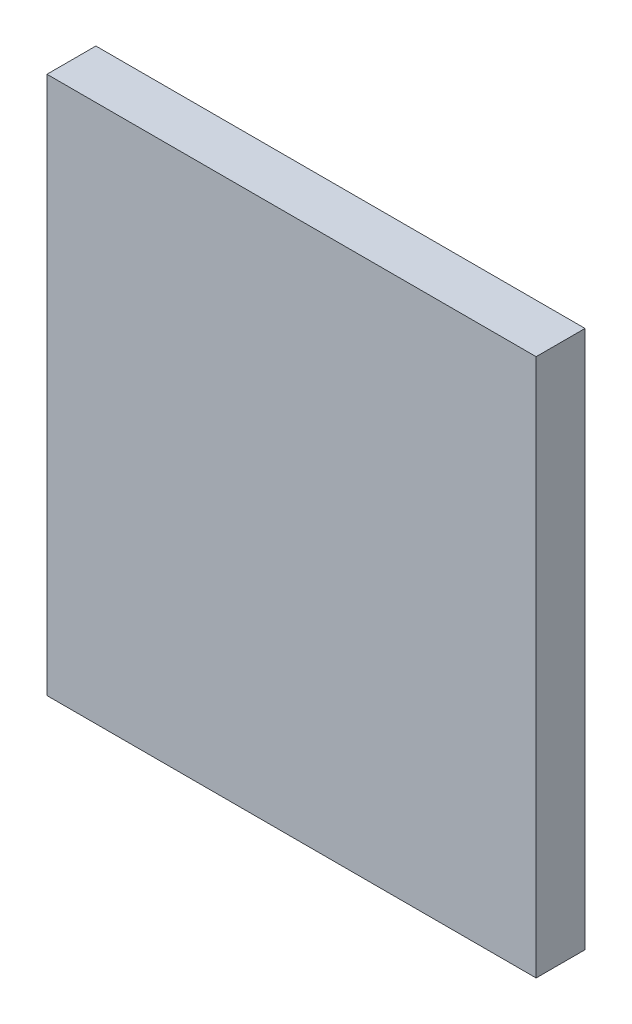
ISO-10303-21;
HEADER;
FILE_DESCRIPTION(('STEP AP214'),'2;1');
FILE_NAME('part.step','',(''),(''),'','','');
FILE_SCHEMA(('AUTOMOTIVE_DESIGN { 1 0 10303 214 1 1 1 1 }'));
ENDSEC;
DATA;
#1=APPLICATION_CONTEXT('core data for automotive mechanical design processes');
#2=APPLICATION_PROTOCOL_DEFINITION('international standard','automotive_design',2000,#1);
#3=PRODUCT_CONTEXT('',#1,'mechanical');
#4=PRODUCT('Part','Part','',(#3));
#5=PRODUCT_RELATED_PRODUCT_CATEGORY('part','',(#4));
#6=PRODUCT_DEFINITION_FORMATION('','',#4);
#7=PRODUCT_DEFINITION_CONTEXT('part definition',#1,'design');
#8=PRODUCT_DEFINITION('design','',#6,#7);
#9=PRODUCT_DEFINITION_SHAPE('','',#8);
#10=(LENGTH_UNIT() NAMED_UNIT(*) SI_UNIT(.MILLI.,.METRE.));
#11=(NAMED_UNIT(*) PLANE_ANGLE_UNIT() SI_UNIT($,.RADIAN.));
#12=(NAMED_UNIT(*) SI_UNIT($,.STERADIAN.) SOLID_ANGLE_UNIT());
#13=UNCERTAINTY_MEASURE_WITH_UNIT(LENGTH_MEASURE(1.E-05),#10,'distance_accuracy_value','');
#14=(GEOMETRIC_REPRESENTATION_CONTEXT(3) GLOBAL_UNCERTAINTY_ASSIGNED_CONTEXT((#13)) GLOBAL_UNIT_ASSIGNED_CONTEXT((#10,
#11,#12)) REPRESENTATION_CONTEXT('',''));
#15=CARTESIAN_POINT('',(0.,0.,0.));
#16=DIRECTION('',(0.,0.,1.));
#17=DIRECTION('',(1.,0.,0.));
#18=AXIS2_PLACEMENT_3D('',#15,#16,#17);
#19=CARTESIAN_POINT('',(0.,16.5000000000054,3.));
#20=DIRECTION('',(-1.,0.,0.));
#21=DIRECTION('',(0.,-1.,0.));
#22=AXIS2_PLACEMENT_3D('',#19,#20,#21);
#23=PLANE('',#22);
#24=DIRECTION('',(0.,1.,0.));
#25=VECTOR('',#24,1.);
#26=CARTESIAN_POINT('',(0.,16.5000000000054,0.));
#27=LINE('',#26,#25);
#28=CARTESIAN_POINT('',(0.,-16.4999999999976,0.));
#29=VERTEX_POINT('',#28);
#30=CARTESIAN_POINT('',(0.,16.5000000000054,0.));
#31=VERTEX_POINT('',#30);
#32=EDGE_CURVE('E98',#29,#31,#27,.T.);
#33=ORIENTED_EDGE('',*,*,#32,.T.);
#34=DIRECTION('',(0.,0.,-1.));
#35=VECTOR('',#34,1.);
#36=CARTESIAN_POINT('',(0.,16.5000000000054,3.));
#37=LINE('',#36,#35);
#38=CARTESIAN_POINT('',(0.,16.5000000000054,3.));
#39=VERTEX_POINT('',#38);
#40=EDGE_CURVE('E11',#39,#31,#37,.T.);
#41=ORIENTED_EDGE('',*,*,#40,.F.);
#42=DIRECTION('',(0.,1.,0.));
#43=VECTOR('',#42,1.);
#44=CARTESIAN_POINT('',(0.,16.5000000000054,3.));
#45=LINE('',#44,#43);
#46=CARTESIAN_POINT('',(0.,-16.4999999999976,3.));
#47=VERTEX_POINT('',#46);
#48=EDGE_CURVE('E86',#47,#39,#45,.T.);
#49=ORIENTED_EDGE('',*,*,#48,.F.);
#50=DIRECTION('',(0.,0.,-1.));
#51=VECTOR('',#50,1.);
#52=CARTESIAN_POINT('',(0.,-16.4999999999976,3.));
#53=LINE('',#52,#51);
#54=EDGE_CURVE('E94',#47,#29,#53,.T.);
#55=ORIENTED_EDGE('',*,*,#54,.T.);
#56=EDGE_LOOP('',(#33,#41,#49,#55));
#57=FACE_BOUND('',#56,.T.);
#58=ADVANCED_FACE('F35',(#57),#23,.F.);
#59=CARTESIAN_POINT('',(0.,16.5000000000054,3.));
#60=DIRECTION('',(0.,-1.,0.));
#61=DIRECTION('',(1.,0.,0.));
#62=AXIS2_PLACEMENT_3D('',#59,#60,#61);
#63=PLANE('',#62);
#64=DIRECTION('',(-1.,0.,0.));
#65=VECTOR('',#64,1.);
#66=CARTESIAN_POINT('',(0.,16.5000000000054,0.));
#67=LINE('',#66,#65);
#68=CARTESIAN_POINT('',(-30.0000000000001,16.5000000000054,0.));
#69=VERTEX_POINT('',#68);
#70=EDGE_CURVE('E90',#31,#69,#67,.T.);
#71=ORIENTED_EDGE('',*,*,#70,.T.);
#72=DIRECTION('',(0.,0.,-1.));
#73=VECTOR('',#72,1.);
#74=CARTESIAN_POINT('',(-30.0000000000001,16.5000000000054,3.));
#75=LINE('',#74,#73);
#76=CARTESIAN_POINT('',(-30.0000000000001,16.5000000000054,3.));
#77=VERTEX_POINT('',#76);
#78=EDGE_CURVE('E43',#77,#69,#75,.T.);
#79=ORIENTED_EDGE('',*,*,#78,.F.);
#80=DIRECTION('',(-1.,0.,0.));
#81=VECTOR('',#80,1.);
#82=CARTESIAN_POINT('',(0.,16.5000000000054,3.));
#83=LINE('',#82,#81);
#84=EDGE_CURVE('E81',#39,#77,#83,.T.);
#85=ORIENTED_EDGE('',*,*,#84,.F.);
#86=ORIENTED_EDGE('',*,*,#40,.T.);
#87=EDGE_LOOP('',(#71,#79,#85,#86));
#88=FACE_BOUND('',#87,.T.);
#89=ADVANCED_FACE('F89',(#88),#63,.F.);
#90=CARTESIAN_POINT('',(-30.0000000000001,16.5000000000054,3.));
#91=DIRECTION('',(1.,0.,0.));
#92=DIRECTION('',(0.,1.,0.));
#93=AXIS2_PLACEMENT_3D('',#90,#91,#92);
#94=PLANE('',#93);
#95=DIRECTION('',(0.,-1.,0.));
#96=VECTOR('',#95,1.);
#97=CARTESIAN_POINT('',(-30.0000000000001,16.5000000000054,0.));
#98=LINE('',#97,#96);
#99=CARTESIAN_POINT('',(-30.,-16.4999999999976,0.));
#100=VERTEX_POINT('',#99);
#101=EDGE_CURVE('E68',#69,#100,#98,.T.);
#102=ORIENTED_EDGE('',*,*,#101,.T.);
#103=DIRECTION('',(0.,0.,-1.));
#104=VECTOR('',#103,1.);
#105=CARTESIAN_POINT('',(-30.,-16.4999999999976,3.));
#106=LINE('',#105,#104);
#107=CARTESIAN_POINT('',(-30.,-16.4999999999976,3.));
#108=VERTEX_POINT('',#107);
#109=EDGE_CURVE('E91',#108,#100,#106,.T.);
#110=ORIENTED_EDGE('',*,*,#109,.F.);
#111=DIRECTION('',(0.,-1.,0.));
#112=VECTOR('',#111,1.);
#113=CARTESIAN_POINT('',(-30.0000000000001,16.5000000000054,3.));
#114=LINE('',#113,#112);
#115=EDGE_CURVE('E84',#77,#108,#114,.T.);
#116=ORIENTED_EDGE('',*,*,#115,.F.);
#117=ORIENTED_EDGE('',*,*,#78,.T.);
#118=EDGE_LOOP('',(#102,#110,#116,#117));
#119=FACE_BOUND('',#118,.T.);
#120=ADVANCED_FACE('F92',(#119),#94,.F.);
#121=CARTESIAN_POINT('',(0.,-16.4999999999976,3.));
#122=DIRECTION('',(0.,1.,0.));
#123=DIRECTION('',(-1.,0.,0.));
#124=AXIS2_PLACEMENT_3D('',#121,#122,#123);
#125=PLANE('',#124);
#126=DIRECTION('',(1.,0.,0.));
#127=VECTOR('',#126,1.);
#128=CARTESIAN_POINT('',(0.,-16.4999999999976,0.));
#129=LINE('',#128,#127);
#130=EDGE_CURVE('E74',#100,#29,#129,.T.);
#131=ORIENTED_EDGE('',*,*,#130,.T.);
#132=ORIENTED_EDGE('',*,*,#54,.F.);
#133=DIRECTION('',(1.,0.,0.));
#134=VECTOR('',#133,1.);
#135=CARTESIAN_POINT('',(0.,-16.4999999999976,3.));
#136=LINE('',#135,#134);
#137=EDGE_CURVE('E51',#108,#47,#136,.T.);
#138=ORIENTED_EDGE('',*,*,#137,.F.);
#139=ORIENTED_EDGE('',*,*,#109,.T.);
#140=EDGE_LOOP('',(#131,#132,#138,#139));
#141=FACE_BOUND('',#140,.T.);
#142=ADVANCED_FACE('F105',(#141),#125,.F.);
#143=CARTESIAN_POINT('',(0.,0.,3.));
#144=DIRECTION('',(0.,0.,-1.));
#145=DIRECTION('',(-1.,0.,0.));
#146=AXIS2_PLACEMENT_3D('',#143,#144,#145);
#147=PLANE('',#146);
#148=ORIENTED_EDGE('',*,*,#48,.T.);
#149=ORIENTED_EDGE('',*,*,#84,.T.);
#150=ORIENTED_EDGE('',*,*,#115,.T.);
#151=ORIENTED_EDGE('',*,*,#137,.T.);
#152=EDGE_LOOP('',(#148,#149,#150,#151));
#153=FACE_BOUND('',#152,.T.);
#154=ADVANCED_FACE('F82',(#153),#147,.F.);
#155=CARTESIAN_POINT('',(0.,0.,0.));
#156=DIRECTION('',(0.,0.,-1.));
#157=DIRECTION('',(-1.,0.,0.));
#158=AXIS2_PLACEMENT_3D('',#155,#156,#157);
#159=PLANE('',#158);
#160=ORIENTED_EDGE('',*,*,#32,.F.);
#161=ORIENTED_EDGE('',*,*,#130,.F.);
#162=ORIENTED_EDGE('',*,*,#101,.F.);
#163=ORIENTED_EDGE('',*,*,#70,.F.);
#164=EDGE_LOOP('',(#160,#161,#162,#163));
#165=FACE_BOUND('',#164,.T.);
#166=ADVANCED_FACE('F108',(#165),#159,.T.);
#167=CLOSED_SHELL('',(#58,#89,#120,#142,#154,#166));
#168=MANIFOLD_SOLID_BREP('B2',#167);
#169=ADVANCED_BREP_SHAPE_REPRESENTATION('',(#18,#168),#14);
#170=SHAPE_DEFINITION_REPRESENTATION(#9,#169);
ENDSEC;
END-ISO-10303-21;
